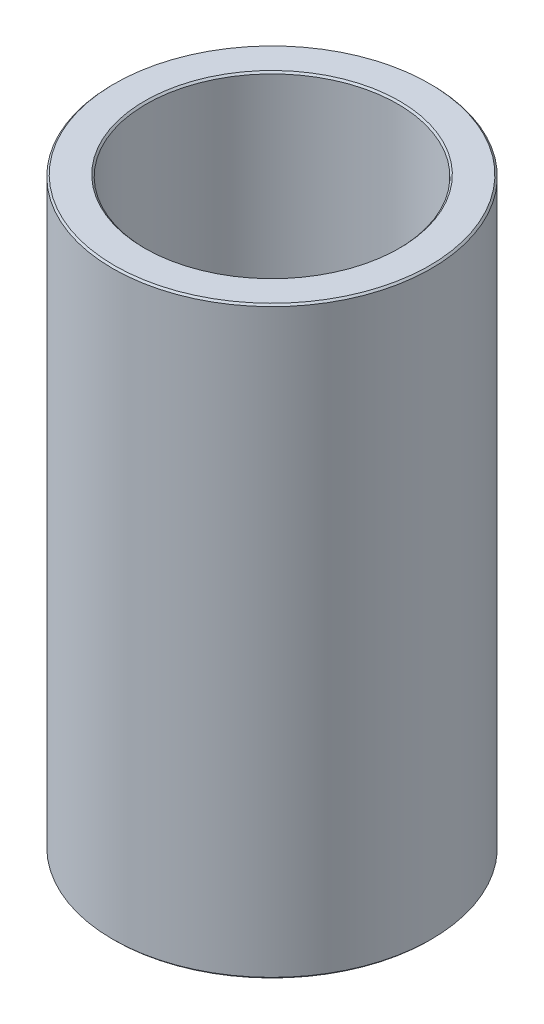
ISO-10303-21;
HEADER;
FILE_DESCRIPTION(('STEP AP214'),'2;1');
FILE_NAME('part.step','',(''),(''),'','','');
FILE_SCHEMA(('AUTOMOTIVE_DESIGN { 1 0 10303 214 1 1 1 1 }'));
ENDSEC;
DATA;
#1=APPLICATION_CONTEXT('core data for automotive mechanical design processes');
#2=APPLICATION_PROTOCOL_DEFINITION('international standard','automotive_design',2000,#1);
#3=PRODUCT_CONTEXT('',#1,'mechanical');
#4=PRODUCT('Part','Part','',(#3));
#5=PRODUCT_RELATED_PRODUCT_CATEGORY('part','',(#4));
#6=PRODUCT_DEFINITION_FORMATION('','',#4);
#7=PRODUCT_DEFINITION_CONTEXT('part definition',#1,'design');
#8=PRODUCT_DEFINITION('design','',#6,#7);
#9=PRODUCT_DEFINITION_SHAPE('','',#8);
#10=(LENGTH_UNIT() NAMED_UNIT(*) SI_UNIT(.MILLI.,.METRE.));
#11=(NAMED_UNIT(*) PLANE_ANGLE_UNIT() SI_UNIT($,.RADIAN.));
#12=(NAMED_UNIT(*) SI_UNIT($,.STERADIAN.) SOLID_ANGLE_UNIT());
#13=UNCERTAINTY_MEASURE_WITH_UNIT(LENGTH_MEASURE(1.E-05),#10,'distance_accuracy_value','');
#14=(GEOMETRIC_REPRESENTATION_CONTEXT(3) GLOBAL_UNCERTAINTY_ASSIGNED_CONTEXT((#13)) GLOBAL_UNIT_ASSIGNED_CONTEXT((#10,
#11,#12)) REPRESENTATION_CONTEXT('',''));
#15=CARTESIAN_POINT('',(0.,0.,0.));
#16=DIRECTION('',(0.,0.,1.));
#17=DIRECTION('',(1.,0.,0.));
#18=AXIS2_PLACEMENT_3D('',#15,#16,#17);
#19=CARTESIAN_POINT('',(0.,183.39459545764,0.));
#20=DIRECTION('',(0.,-1.,0.));
#21=DIRECTION('',(0.,0.,-1.));
#22=AXIS2_PLACEMENT_3D('',#19,#20,#21);
#23=CYLINDRICAL_SURFACE('',#22,50.);
#24=CARTESIAN_POINT('',(0.,0.541928896762495,0.));
#25=DIRECTION('',(0.,1.,0.));
#26=DIRECTION('',(0.,0.,1.));
#27=AXIS2_PLACEMENT_3D('',#24,#25,#26);
#28=CIRCLE('',#27,50.);
#29=CARTESIAN_POINT('',(0.,0.541928896762495,50.));
#30=VERTEX_POINT('',#29);
#31=EDGE_CURVE('E10',#30,#30,#28,.T.);
#32=ORIENTED_EDGE('',*,*,#31,.T.);
#33=EDGE_LOOP('',(#32));
#34=FACE_BOUND('',#33,.T.);
#35=CARTESIAN_POINT('',(0.,182.852666560877,0.));
#36=DIRECTION('',(0.,1.,0.));
#37=DIRECTION('',(0.,0.,1.));
#38=AXIS2_PLACEMENT_3D('',#35,#36,#37);
#39=CIRCLE('',#38,50.);
#40=CARTESIAN_POINT('',(0.,182.852666560877,50.));
#41=VERTEX_POINT('',#40);
#42=EDGE_CURVE('E50',#41,#41,#39,.F.);
#43=ORIENTED_EDGE('',*,*,#42,.T.);
#44=EDGE_LOOP('',(#43));
#45=FACE_BOUND('',#44,.T.);
#46=ADVANCED_FACE('F39',(#34,#45),#23,.T.);
#47=CARTESIAN_POINT('',(0.,183.39459545764,0.));
#48=DIRECTION('',(0.,1.,0.));
#49=DIRECTION('',(0.,0.,1.));
#50=AXIS2_PLACEMENT_3D('',#47,#48,#49);
#51=PLANE('',#50);
#52=CARTESIAN_POINT('',(0.,183.39459545764,0.));
#53=DIRECTION('',(0.,1.,0.));
#54=DIRECTION('',(0.,0.,1.));
#55=AXIS2_PLACEMENT_3D('',#52,#53,#54);
#56=CIRCLE('',#55,40.020242716402);
#57=CARTESIAN_POINT('',(0.,183.39459545764,40.020242716402));
#58=VERTEX_POINT('',#57);
#59=EDGE_CURVE('E58',#58,#58,#56,.F.);
#60=ORIENTED_EDGE('',*,*,#59,.T.);
#61=EDGE_LOOP('',(#60));
#62=FACE_BOUND('',#61,.T.);
#63=CARTESIAN_POINT('',(0.,183.39459545764,0.));
#64=DIRECTION('',(0.,1.,0.));
#65=DIRECTION('',(0.,0.,1.));
#66=AXIS2_PLACEMENT_3D('',#63,#64,#65);
#67=CIRCLE('',#66,49.4580711032375);
#68=CARTESIAN_POINT('',(0.,183.39459545764,49.4580711032375));
#69=VERTEX_POINT('',#68);
#70=EDGE_CURVE('E61',#69,#69,#67,.T.);
#71=ORIENTED_EDGE('',*,*,#70,.T.);
#72=EDGE_LOOP('',(#71));
#73=FACE_BOUND('',#72,.T.);
#74=ADVANCED_FACE('F88',(#62,#73),#51,.T.);
#75=CARTESIAN_POINT('',(0.,0.,0.));
#76=DIRECTION('',(0.,1.,0.));
#77=DIRECTION('',(0.,0.,1.));
#78=AXIS2_PLACEMENT_3D('',#75,#76,#77);
#79=PLANE('',#78);
#80=CARTESIAN_POINT('',(0.,0.,0.));
#81=DIRECTION('',(0.,1.,0.));
#82=DIRECTION('',(0.,0.,1.));
#83=AXIS2_PLACEMENT_3D('',#80,#81,#82);
#84=CIRCLE('',#83,40.0202427164021);
#85=CARTESIAN_POINT('',(0.,0.,40.0202427164021));
#86=VERTEX_POINT('',#85);
#87=EDGE_CURVE('E51',#86,#86,#84,.T.);
#88=ORIENTED_EDGE('',*,*,#87,.T.);
#89=EDGE_LOOP('',(#88));
#90=FACE_BOUND('',#89,.T.);
#91=CARTESIAN_POINT('',(0.,0.,0.));
#92=DIRECTION('',(0.,1.,0.));
#93=DIRECTION('',(0.,0.,1.));
#94=AXIS2_PLACEMENT_3D('',#91,#92,#93);
#95=CIRCLE('',#94,49.4580711032375);
#96=CARTESIAN_POINT('',(0.,0.,49.4580711032375));
#97=VERTEX_POINT('',#96);
#98=EDGE_CURVE('E54',#97,#97,#95,.F.);
#99=ORIENTED_EDGE('',*,*,#98,.T.);
#100=EDGE_LOOP('',(#99));
#101=FACE_BOUND('',#100,.T.);
#102=ADVANCED_FACE('F83',(#90,#101),#79,.F.);
#103=CARTESIAN_POINT('',(0.,183.39459545764,0.));
#104=DIRECTION('',(0.,-1.,0.));
#105=DIRECTION('',(0.,0.,-1.));
#106=AXIS2_PLACEMENT_3D('',#103,#104,#105);
#107=CYLINDRICAL_SURFACE('',#106,39.4783138196396);
#108=CARTESIAN_POINT('',(0.,182.852666560877,0.));
#109=DIRECTION('',(0.,1.,0.));
#110=DIRECTION('',(0.,0.,1.));
#111=AXIS2_PLACEMENT_3D('',#108,#109,#110);
#112=CIRCLE('',#111,39.4783138196396);
#113=CARTESIAN_POINT('',(0.,182.852666560877,39.4783138196396));
#114=VERTEX_POINT('',#113);
#115=EDGE_CURVE('E67',#114,#114,#112,.T.);
#116=ORIENTED_EDGE('',*,*,#115,.T.);
#117=EDGE_LOOP('',(#116));
#118=FACE_BOUND('',#117,.T.);
#119=CARTESIAN_POINT('',(0.,0.541928896762495,0.));
#120=DIRECTION('',(0.,1.,0.));
#121=DIRECTION('',(0.,0.,1.));
#122=AXIS2_PLACEMENT_3D('',#119,#120,#121);
#123=CIRCLE('',#122,39.4783138196396);
#124=CARTESIAN_POINT('',(0.,0.541928896762495,39.4783138196396));
#125=VERTEX_POINT('',#124);
#126=EDGE_CURVE('E69',#125,#125,#123,.F.);
#127=ORIENTED_EDGE('',*,*,#126,.T.);
#128=EDGE_LOOP('',(#127));
#129=FACE_BOUND('',#128,.T.);
#130=ADVANCED_FACE('F71',(#118,#129),#107,.F.);
#131=CARTESIAN_POINT('',(0.,182.852666560877,0.));
#132=DIRECTION('',(0.,1.,0.));
#133=DIRECTION('',(0.,0.,1.));
#134=AXIS2_PLACEMENT_3D('',#131,#132,#133);
#135=CONICAL_SURFACE('',#134,39.4783138196396,0.785398163397448);
#136=ORIENTED_EDGE('',*,*,#59,.F.);
#137=EDGE_LOOP('',(#136));
#138=FACE_BOUND('',#137,.T.);
#139=ORIENTED_EDGE('',*,*,#115,.F.);
#140=EDGE_LOOP('',(#139));
#141=FACE_BOUND('',#140,.T.);
#142=ADVANCED_FACE('F77',(#138,#141),#135,.F.);
#143=CARTESIAN_POINT('',(0.,0.,0.));
#144=DIRECTION('',(0.,-1.,0.));
#145=DIRECTION('',(0.,0.,-1.));
#146=AXIS2_PLACEMENT_3D('',#143,#144,#145);
#147=CONICAL_SURFACE('',#146,40.0202427164021,0.785398163397448);
#148=ORIENTED_EDGE('',*,*,#126,.F.);
#149=EDGE_LOOP('',(#148));
#150=FACE_BOUND('',#149,.T.);
#151=ORIENTED_EDGE('',*,*,#87,.F.);
#152=EDGE_LOOP('',(#151));
#153=FACE_BOUND('',#152,.T.);
#154=ADVANCED_FACE('F73',(#150,#153),#147,.F.);
#155=CARTESIAN_POINT('',(0.,0.541928896762495,0.));
#156=DIRECTION('',(0.,1.,0.));
#157=DIRECTION('',(0.,0.,1.));
#158=AXIS2_PLACEMENT_3D('',#155,#156,#157);
#159=CONICAL_SURFACE('',#158,50.,0.785398163397429);
#160=ORIENTED_EDGE('',*,*,#98,.F.);
#161=EDGE_LOOP('',(#160));
#162=FACE_BOUND('',#161,.T.);
#163=ORIENTED_EDGE('',*,*,#31,.F.);
#164=EDGE_LOOP('',(#163));
#165=FACE_BOUND('',#164,.T.);
#166=ADVANCED_FACE('F76',(#162,#165),#159,.T.);
#167=CARTESIAN_POINT('',(0.,183.39459545764,0.));
#168=DIRECTION('',(0.,-1.,0.));
#169=DIRECTION('',(0.,0.,-1.));
#170=AXIS2_PLACEMENT_3D('',#167,#168,#169);
#171=CONICAL_SURFACE('',#170,49.4580711032375,0.785398163397436);
#172=ORIENTED_EDGE('',*,*,#42,.F.);
#173=EDGE_LOOP('',(#172));
#174=FACE_BOUND('',#173,.T.);
#175=ORIENTED_EDGE('',*,*,#70,.F.);
#176=EDGE_LOOP('',(#175));
#177=FACE_BOUND('',#176,.T.);
#178=ADVANCED_FACE('F45',(#174,#177),#171,.T.);
#179=CLOSED_SHELL('',(#46,#74,#102,#130,#142,#154,#166,#178));
#180=MANIFOLD_SOLID_BREP('B2',#179);
#181=ADVANCED_BREP_SHAPE_REPRESENTATION('',(#18,#180),#14);
#182=SHAPE_DEFINITION_REPRESENTATION(#9,#181);
ENDSEC;
END-ISO-10303-21;
